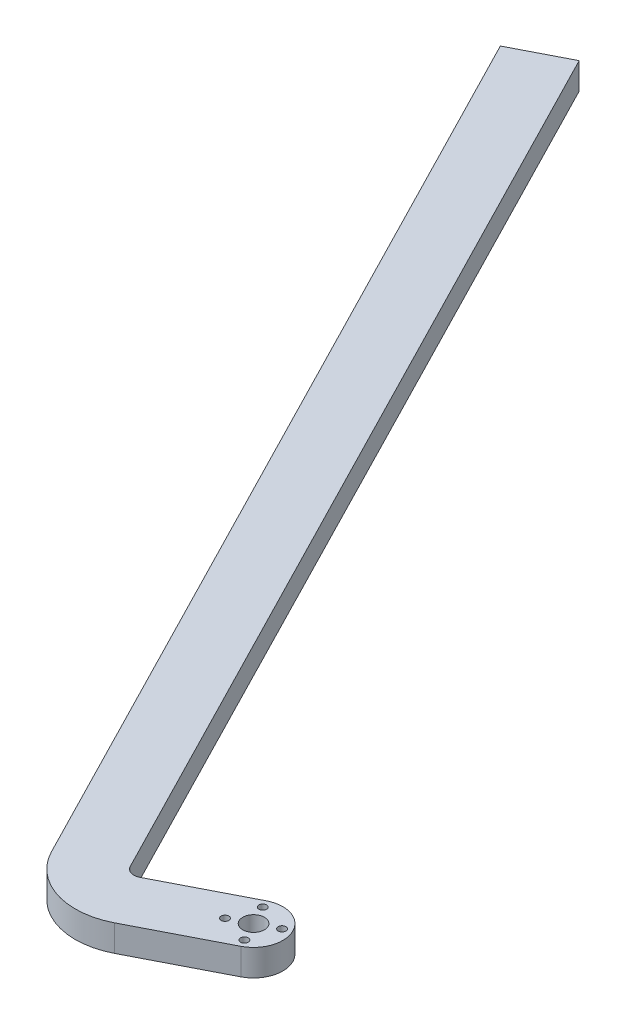
ISO-10303-21;
HEADER;
FILE_DESCRIPTION(('STEP AP214'),'2;1');
FILE_NAME('part.step','',(''),(''),'','','');
FILE_SCHEMA(('AUTOMOTIVE_DESIGN { 1 0 10303 214 1 1 1 1 }'));
ENDSEC;
DATA;
#1=APPLICATION_CONTEXT('core data for automotive mechanical design processes');
#2=APPLICATION_PROTOCOL_DEFINITION('international standard','automotive_design',2000,#1);
#3=PRODUCT_CONTEXT('',#1,'mechanical');
#4=PRODUCT('Part','Part','',(#3));
#5=PRODUCT_RELATED_PRODUCT_CATEGORY('part','',(#4));
#6=PRODUCT_DEFINITION_FORMATION('','',#4);
#7=PRODUCT_DEFINITION_CONTEXT('part definition',#1,'design');
#8=PRODUCT_DEFINITION('design','',#6,#7);
#9=PRODUCT_DEFINITION_SHAPE('','',#8);
#10=(LENGTH_UNIT() NAMED_UNIT(*) SI_UNIT(.MILLI.,.METRE.));
#11=(NAMED_UNIT(*) PLANE_ANGLE_UNIT() SI_UNIT($,.RADIAN.));
#12=(NAMED_UNIT(*) SI_UNIT($,.STERADIAN.) SOLID_ANGLE_UNIT());
#13=UNCERTAINTY_MEASURE_WITH_UNIT(LENGTH_MEASURE(1.E-05),#10,'distance_accuracy_value','');
#14=(GEOMETRIC_REPRESENTATION_CONTEXT(3) GLOBAL_UNCERTAINTY_ASSIGNED_CONTEXT((#13)) GLOBAL_UNIT_ASSIGNED_CONTEXT((#10,
#11,#12)) REPRESENTATION_CONTEXT('',''));
#15=CARTESIAN_POINT('',(0.,0.,0.));
#16=DIRECTION('',(0.,0.,1.));
#17=DIRECTION('',(1.,0.,0.));
#18=AXIS2_PLACEMENT_3D('',#15,#16,#17);
#19=CARTESIAN_POINT('',(-38.3857865547846,10.,2.7997402459546));
#20=DIRECTION('',(0.,-1.,0.));
#21=DIRECTION('',(0.,0.,-1.));
#22=AXIS2_PLACEMENT_3D('',#19,#20,#21);
#23=PLANE('',#22);
#24=DIRECTION('',(-0.889656473136453,0.,0.456630441173612));
#25=VECTOR('',#24,1.);
#26=CARTESIAN_POINT('',(-220.641241200218,10.,-343.557880956116));
#27=LINE('',#26,#25);
#28=CARTESIAN_POINT('',(-220.641241200218,10.,-343.557880956116));
#29=VERTEX_POINT('',#28);
#30=CARTESIAN_POINT('',(-240.302649256533,10.,-333.466348206179));
#31=VERTEX_POINT('',#30);
#32=EDGE_CURVE('E149',#29,#31,#27,.T.);
#33=ORIENTED_EDGE('',*,*,#32,.T.);
#34=DIRECTION('',(0.456630441173611,0.,0.889656473136454));
#35=VECTOR('',#34,1.);
#36=CARTESIAN_POINT('',(-61.5945322010366,10.,14.7120008583817));
#37=LINE('',#36,#35);
#38=CARTESIAN_POINT('',(-61.5945322010366,10.,14.7120008583817));
#39=VERTEX_POINT('',#38);
#40=EDGE_CURVE('E97',#31,#39,#37,.T.);
#41=ORIENTED_EDGE('',*,*,#40,.T.);
#42=CARTESIAN_POINT('',(-38.3857865547846,10.,2.7997402459546));
#43=DIRECTION('',(0.,1.,0.));
#44=DIRECTION('',(0.,0.,-1.));
#45=AXIS2_PLACEMENT_3D('',#42,#43,#44);
#46=CIRCLE('',#45,26.0873116163932);
#47=CARTESIAN_POINT('',(-26.4735259423575,10.,26.0084858922066));
#48=VERTEX_POINT('',#47);
#49=EDGE_CURVE('E164',#39,#48,#46,.T.);
#50=ORIENTED_EDGE('',*,*,#49,.T.);
#51=DIRECTION('',(0.889656473136454,0.,-0.456630441173611));
#52=VECTOR('',#51,1.);
#53=CARTESIAN_POINT('',(5.0457663749684,10.,9.83070402815781));
#54=LINE('',#53,#52);
#55=CARTESIAN_POINT('',(5.0457663749684,10.,9.83070402815781));
#56=VERTEX_POINT('',#55);
#57=EDGE_CURVE('E177',#48,#56,#54,.T.);
#58=ORIENTED_EDGE('',*,*,#57,.T.);
#59=CARTESIAN_POINT('',(0.,10.,0.));
#60=DIRECTION('',(0.,1.,0.));
#61=DIRECTION('',(0.,0.,1.));
#62=AXIS2_PLACEMENT_3D('',#59,#60,#61);
#63=CIRCLE('',#62,11.05);
#64=CARTESIAN_POINT('',(-5.0457663749684,10.,-9.83070402815781));
#65=VERTEX_POINT('',#64);
#66=EDGE_CURVE('E116',#56,#65,#63,.T.);
#67=ORIENTED_EDGE('',*,*,#66,.T.);
#68=DIRECTION('',(-0.889656473136454,0.,0.456630441173611));
#69=VECTOR('',#68,1.);
#70=CARTESIAN_POINT('',(-5.0457663749684,10.,-9.83070402815781));
#71=LINE('',#70,#69);
#72=CARTESIAN_POINT('',(-36.5650586922943,10.,6.34707783589098));
#73=VERTEX_POINT('',#72);
#74=EDGE_CURVE('E110',#65,#73,#71,.T.);
#75=ORIENTED_EDGE('',*,*,#74,.T.);
#76=CARTESIAN_POINT('',(-38.3857865547846,10.,2.79974024595459));
#77=DIRECTION('',(0.,-1.,0.));
#78=DIRECTION('',(0.,0.,-1.));
#79=AXIS2_PLACEMENT_3D('',#76,#77,#78);
#80=CIRCLE('',#79,3.98731161639319);
#81=CARTESIAN_POINT('',(-41.933124144721,10.,4.62046810844488));
#82=VERTEX_POINT('',#81);
#83=EDGE_CURVE('E114',#73,#82,#80,.T.);
#84=ORIENTED_EDGE('',*,*,#83,.T.);
#85=DIRECTION('',(-0.456630441173611,0.,-0.889656473136454));
#86=VECTOR('',#85,1.);
#87=CARTESIAN_POINT('',(-41.933124144721,10.,4.62046810844488));
#88=LINE('',#87,#86);
#89=EDGE_CURVE('E54',#82,#29,#88,.T.);
#90=ORIENTED_EDGE('',*,*,#89,.T.);
#91=EDGE_LOOP('',(#33,#41,#50,#58,#67,#75,#84,#90));
#92=FACE_BOUND('',#91,.T.);
#93=CARTESIAN_POINT('',(3.65304352938889,10.,7.11725178509162));
#94=DIRECTION('',(0.,1.,0.));
#95=DIRECTION('',(0.,0.,1.));
#96=AXIS2_PLACEMENT_3D('',#93,#94,#95);
#97=CIRCLE('',#96,1.45500000000002);
#98=CARTESIAN_POINT('',(3.65304352938889,10.,8.57225178509164));
#99=VERTEX_POINT('',#98);
#100=EDGE_CURVE('E138',#99,#99,#97,.T.);
#101=ORIENTED_EDGE('',*,*,#100,.F.);
#102=EDGE_LOOP('',(#101));
#103=FACE_BOUND('',#102,.T.);
#104=CARTESIAN_POINT('',(0.,10.,0.));
#105=DIRECTION('',(0.,1.,0.));
#106=DIRECTION('',(0.,0.,1.));
#107=AXIS2_PLACEMENT_3D('',#104,#105,#106);
#108=CIRCLE('',#107,4.09999999999999);
#109=CARTESIAN_POINT('',(0.,10.,4.09999999999999));
#110=VERTEX_POINT('',#109);
#111=EDGE_CURVE('E186',#110,#110,#108,.T.);
#112=ORIENTED_EDGE('',*,*,#111,.F.);
#113=EDGE_LOOP('',(#112));
#114=FACE_BOUND('',#113,.T.);
#115=CARTESIAN_POINT('',(-7.11725178509165,10.,3.6530435293889));
#116=DIRECTION('',(0.,1.,0.));
#117=DIRECTION('',(0.,0.,1.));
#118=AXIS2_PLACEMENT_3D('',#115,#116,#117);
#119=CIRCLE('',#118,1.45500000000002);
#120=CARTESIAN_POINT('',(-7.11725178509165,10.,5.10804352938892));
#121=VERTEX_POINT('',#120);
#122=EDGE_CURVE('E192',#121,#121,#119,.T.);
#123=ORIENTED_EDGE('',*,*,#122,.F.);
#124=EDGE_LOOP('',(#123));
#125=FACE_BOUND('',#124,.T.);
#126=CARTESIAN_POINT('',(7.11725178509159,10.,-3.65304352938887));
#127=DIRECTION('',(0.,1.,0.));
#128=DIRECTION('',(0.,0.,1.));
#129=AXIS2_PLACEMENT_3D('',#126,#127,#128);
#130=CIRCLE('',#129,1.45500000000002);
#131=CARTESIAN_POINT('',(7.11725178509159,10.,-2.19804352938885));
#132=VERTEX_POINT('',#131);
#133=EDGE_CURVE('E198',#132,#132,#130,.T.);
#134=ORIENTED_EDGE('',*,*,#133,.F.);
#135=EDGE_LOOP('',(#134));
#136=FACE_BOUND('',#135,.T.);
#137=CARTESIAN_POINT('',(-3.65304352938889,10.,-7.11725178509164));
#138=DIRECTION('',(0.,1.,0.));
#139=DIRECTION('',(0.,0.,1.));
#140=AXIS2_PLACEMENT_3D('',#137,#138,#139);
#141=CIRCLE('',#140,1.45500000000002);
#142=CARTESIAN_POINT('',(-3.65304352938889,10.,-5.66225178509162));
#143=VERTEX_POINT('',#142);
#144=EDGE_CURVE('E204',#143,#143,#141,.T.);
#145=ORIENTED_EDGE('',*,*,#144,.F.);
#146=EDGE_LOOP('',(#145));
#147=FACE_BOUND('',#146,.T.);
#148=ADVANCED_FACE('F37',(#92,#103,#114,#125,#136,#147),#23,.F.);
#149=CARTESIAN_POINT('',(-38.3857865547846,0.,2.7997402459546));
#150=DIRECTION('',(0.,-1.,0.));
#151=DIRECTION('',(0.,0.,-1.));
#152=AXIS2_PLACEMENT_3D('',#149,#150,#151);
#153=PLANE('',#152);
#154=CARTESIAN_POINT('',(7.11725178509159,0.,-3.65304352938887));
#155=DIRECTION('',(0.,1.,0.));
#156=DIRECTION('',(0.,0.,1.));
#157=AXIS2_PLACEMENT_3D('',#154,#155,#156);
#158=CIRCLE('',#157,1.45500000000002);
#159=CARTESIAN_POINT('',(7.11725178509159,0.,-2.19804352938885));
#160=VERTEX_POINT('',#159);
#161=EDGE_CURVE('E201',#160,#160,#158,.T.);
#162=ORIENTED_EDGE('',*,*,#161,.T.);
#163=EDGE_LOOP('',(#162));
#164=FACE_BOUND('',#163,.T.);
#165=CARTESIAN_POINT('',(0.,0.,0.));
#166=DIRECTION('',(0.,1.,0.));
#167=DIRECTION('',(0.,0.,1.));
#168=AXIS2_PLACEMENT_3D('',#165,#166,#167);
#169=CIRCLE('',#168,4.09999999999999);
#170=CARTESIAN_POINT('',(0.,0.,4.09999999999999));
#171=VERTEX_POINT('',#170);
#172=EDGE_CURVE('E189',#171,#171,#169,.T.);
#173=ORIENTED_EDGE('',*,*,#172,.T.);
#174=EDGE_LOOP('',(#173));
#175=FACE_BOUND('',#174,.T.);
#176=DIRECTION('',(-0.889656473136453,0.,0.456630441173612));
#177=VECTOR('',#176,1.);
#178=CARTESIAN_POINT('',(-220.641241200218,0.,-343.557880956116));
#179=LINE('',#178,#177);
#180=CARTESIAN_POINT('',(-220.641241200218,0.,-343.557880956116));
#181=VERTEX_POINT('',#180);
#182=CARTESIAN_POINT('',(-240.302649256533,0.,-333.466348206179));
#183=VERTEX_POINT('',#182);
#184=EDGE_CURVE('E134',#181,#183,#179,.T.);
#185=ORIENTED_EDGE('',*,*,#184,.F.);
#186=DIRECTION('',(-0.456630441173611,0.,-0.889656473136454));
#187=VECTOR('',#186,1.);
#188=CARTESIAN_POINT('',(-41.933124144721,0.,4.62046810844488));
#189=LINE('',#188,#187);
#190=CARTESIAN_POINT('',(-41.933124144721,0.,4.62046810844488));
#191=VERTEX_POINT('',#190);
#192=EDGE_CURVE('E89',#191,#181,#189,.T.);
#193=ORIENTED_EDGE('',*,*,#192,.F.);
#194=CARTESIAN_POINT('',(-38.3857865547846,0.,2.79974024595459));
#195=DIRECTION('',(0.,-1.,0.));
#196=DIRECTION('',(0.,0.,-1.));
#197=AXIS2_PLACEMENT_3D('',#194,#195,#196);
#198=CIRCLE('',#197,3.98731161639319);
#199=CARTESIAN_POINT('',(-36.5650586922943,0.,6.34707783589098));
#200=VERTEX_POINT('',#199);
#201=EDGE_CURVE('E83',#200,#191,#198,.T.);
#202=ORIENTED_EDGE('',*,*,#201,.F.);
#203=DIRECTION('',(-0.889656473136454,0.,0.456630441173611));
#204=VECTOR('',#203,1.);
#205=CARTESIAN_POINT('',(-5.0457663749684,0.,-9.83070402815781));
#206=LINE('',#205,#204);
#207=CARTESIAN_POINT('',(-5.0457663749684,0.,-9.83070402815781));
#208=VERTEX_POINT('',#207);
#209=EDGE_CURVE('E124',#208,#200,#206,.T.);
#210=ORIENTED_EDGE('',*,*,#209,.F.);
#211=CARTESIAN_POINT('',(0.,0.,0.));
#212=DIRECTION('',(0.,1.,0.));
#213=DIRECTION('',(0.,0.,1.));
#214=AXIS2_PLACEMENT_3D('',#211,#212,#213);
#215=CIRCLE('',#214,11.05);
#216=CARTESIAN_POINT('',(5.0457663749684,0.,9.83070402815781));
#217=VERTEX_POINT('',#216);
#218=EDGE_CURVE('E144',#217,#208,#215,.T.);
#219=ORIENTED_EDGE('',*,*,#218,.F.);
#220=DIRECTION('',(0.889656473136454,0.,-0.456630441173611));
#221=VECTOR('',#220,1.);
#222=CARTESIAN_POINT('',(5.0457663749684,0.,9.83070402815781));
#223=LINE('',#222,#221);
#224=CARTESIAN_POINT('',(-26.4735259423575,0.,26.0084858922066));
#225=VERTEX_POINT('',#224);
#226=EDGE_CURVE('E142',#225,#217,#223,.T.);
#227=ORIENTED_EDGE('',*,*,#226,.F.);
#228=CARTESIAN_POINT('',(-38.3857865547846,0.,2.7997402459546));
#229=DIRECTION('',(0.,1.,0.));
#230=DIRECTION('',(0.,0.,-1.));
#231=AXIS2_PLACEMENT_3D('',#228,#229,#230);
#232=CIRCLE('',#231,26.0873116163932);
#233=CARTESIAN_POINT('',(-61.5945322010366,0.,14.7120008583817));
#234=VERTEX_POINT('',#233);
#235=EDGE_CURVE('E140',#234,#225,#232,.T.);
#236=ORIENTED_EDGE('',*,*,#235,.F.);
#237=DIRECTION('',(0.456630441173611,0.,0.889656473136454));
#238=VECTOR('',#237,1.);
#239=CARTESIAN_POINT('',(-61.5945322010366,0.,14.7120008583817));
#240=LINE('',#239,#238);
#241=EDGE_CURVE('E137',#183,#234,#240,.T.);
#242=ORIENTED_EDGE('',*,*,#241,.F.);
#243=EDGE_LOOP('',(#185,#193,#202,#210,#219,#227,#236,#242));
#244=FACE_BOUND('',#243,.T.);
#245=CARTESIAN_POINT('',(3.65304352938889,0.,7.11725178509162));
#246=DIRECTION('',(0.,1.,0.));
#247=DIRECTION('',(0.,0.,1.));
#248=AXIS2_PLACEMENT_3D('',#245,#246,#247);
#249=CIRCLE('',#248,1.45500000000002);
#250=CARTESIAN_POINT('',(3.65304352938889,0.,8.57225178509164));
#251=VERTEX_POINT('',#250);
#252=EDGE_CURVE('E183',#251,#251,#249,.T.);
#253=ORIENTED_EDGE('',*,*,#252,.T.);
#254=EDGE_LOOP('',(#253));
#255=FACE_BOUND('',#254,.T.);
#256=CARTESIAN_POINT('',(-7.11725178509165,0.,3.6530435293889));
#257=DIRECTION('',(0.,1.,0.));
#258=DIRECTION('',(0.,0.,1.));
#259=AXIS2_PLACEMENT_3D('',#256,#257,#258);
#260=CIRCLE('',#259,1.45500000000002);
#261=CARTESIAN_POINT('',(-7.11725178509165,0.,5.10804352938892));
#262=VERTEX_POINT('',#261);
#263=EDGE_CURVE('E195',#262,#262,#260,.T.);
#264=ORIENTED_EDGE('',*,*,#263,.T.);
#265=EDGE_LOOP('',(#264));
#266=FACE_BOUND('',#265,.T.);
#267=CARTESIAN_POINT('',(-3.65304352938889,0.,-7.11725178509164));
#268=DIRECTION('',(0.,1.,0.));
#269=DIRECTION('',(0.,0.,1.));
#270=AXIS2_PLACEMENT_3D('',#267,#268,#269);
#271=CIRCLE('',#270,1.45500000000002);
#272=CARTESIAN_POINT('',(-3.65304352938889,0.,-5.66225178509162));
#273=VERTEX_POINT('',#272);
#274=EDGE_CURVE('E207',#273,#273,#271,.T.);
#275=ORIENTED_EDGE('',*,*,#274,.T.);
#276=EDGE_LOOP('',(#275));
#277=FACE_BOUND('',#276,.T.);
#278=ADVANCED_FACE('F168',(#164,#175,#244,#255,#266,#277),#153,.T.);
#279=CARTESIAN_POINT('',(-220.641241200218,10.,-343.557880956116));
#280=DIRECTION('',(0.456630441173612,0.,0.889656473136453));
#281=DIRECTION('',(0.889656473136453,0.,-0.456630441173612));
#282=AXIS2_PLACEMENT_3D('',#279,#280,#281);
#283=PLANE('',#282);
#284=ORIENTED_EDGE('',*,*,#184,.T.);
#285=DIRECTION('',(0.,-1.,0.));
#286=VECTOR('',#285,1.);
#287=CARTESIAN_POINT('',(-240.302649256533,10.,-333.466348206179));
#288=LINE('',#287,#286);
#289=EDGE_CURVE('E11',#31,#183,#288,.T.);
#290=ORIENTED_EDGE('',*,*,#289,.F.);
#291=ORIENTED_EDGE('',*,*,#32,.F.);
#292=DIRECTION('',(0.,-1.,0.));
#293=VECTOR('',#292,1.);
#294=CARTESIAN_POINT('',(-220.641241200218,10.,-343.557880956116));
#295=LINE('',#294,#293);
#296=EDGE_CURVE('E130',#29,#181,#295,.T.);
#297=ORIENTED_EDGE('',*,*,#296,.T.);
#298=EDGE_LOOP('',(#284,#290,#291,#297));
#299=FACE_BOUND('',#298,.T.);
#300=ADVANCED_FACE('F39',(#299),#283,.F.);
#301=CARTESIAN_POINT('',(-61.5945322010366,10.,14.7120008583817));
#302=DIRECTION('',(0.889656473136454,0.,-0.456630441173611));
#303=DIRECTION('',(-0.456630441173611,0.,-0.889656473136454));
#304=AXIS2_PLACEMENT_3D('',#301,#302,#303);
#305=PLANE('',#304);
#306=ORIENTED_EDGE('',*,*,#241,.T.);
#307=DIRECTION('',(0.,-1.,0.));
#308=VECTOR('',#307,1.);
#309=CARTESIAN_POINT('',(-61.5945322010366,10.,14.7120008583817));
#310=LINE('',#309,#308);
#311=EDGE_CURVE('E46',#39,#234,#310,.T.);
#312=ORIENTED_EDGE('',*,*,#311,.F.);
#313=ORIENTED_EDGE('',*,*,#40,.F.);
#314=ORIENTED_EDGE('',*,*,#289,.T.);
#315=EDGE_LOOP('',(#306,#312,#313,#314));
#316=FACE_BOUND('',#315,.T.);
#317=ADVANCED_FACE('F239',(#316),#305,.F.);
#318=CARTESIAN_POINT('',(-38.3857865547846,10.,2.7997402459546));
#319=DIRECTION('',(0.,-1.,0.));
#320=DIRECTION('',(0.,0.,-1.));
#321=AXIS2_PLACEMENT_3D('',#318,#319,#320);
#322=CYLINDRICAL_SURFACE('',#321,26.0873116163932);
#323=ORIENTED_EDGE('',*,*,#235,.T.);
#324=DIRECTION('',(0.,-1.,0.));
#325=VECTOR('',#324,1.);
#326=CARTESIAN_POINT('',(-26.4735259423575,10.,26.0084858922066));
#327=LINE('',#326,#325);
#328=EDGE_CURVE('E156',#48,#225,#327,.T.);
#329=ORIENTED_EDGE('',*,*,#328,.F.);
#330=ORIENTED_EDGE('',*,*,#49,.F.);
#331=ORIENTED_EDGE('',*,*,#311,.T.);
#332=EDGE_LOOP('',(#323,#329,#330,#331));
#333=FACE_BOUND('',#332,.T.);
#334=ADVANCED_FACE('F162',(#333),#322,.T.);
#335=CARTESIAN_POINT('',(5.0457663749684,10.,9.83070402815781));
#336=DIRECTION('',(-0.456630441173611,0.,-0.889656473136454));
#337=DIRECTION('',(-0.889656473136454,0.,0.456630441173611));
#338=AXIS2_PLACEMENT_3D('',#335,#336,#337);
#339=PLANE('',#338);
#340=ORIENTED_EDGE('',*,*,#226,.T.);
#341=DIRECTION('',(0.,-1.,0.));
#342=VECTOR('',#341,1.);
#343=CARTESIAN_POINT('',(5.0457663749684,10.,9.83070402815781));
#344=LINE('',#343,#342);
#345=EDGE_CURVE('E153',#56,#217,#344,.T.);
#346=ORIENTED_EDGE('',*,*,#345,.F.);
#347=ORIENTED_EDGE('',*,*,#57,.F.);
#348=ORIENTED_EDGE('',*,*,#328,.T.);
#349=EDGE_LOOP('',(#340,#346,#347,#348));
#350=FACE_BOUND('',#349,.T.);
#351=ADVANCED_FACE('F173',(#350),#339,.F.);
#352=CARTESIAN_POINT('',(0.,10.,0.));
#353=DIRECTION('',(0.,-1.,0.));
#354=DIRECTION('',(0.,0.,-1.));
#355=AXIS2_PLACEMENT_3D('',#352,#353,#354);
#356=CYLINDRICAL_SURFACE('',#355,11.05);
#357=ORIENTED_EDGE('',*,*,#218,.T.);
#358=DIRECTION('',(0.,-1.,0.));
#359=VECTOR('',#358,1.);
#360=CARTESIAN_POINT('',(-5.0457663749684,10.,-9.83070402815781));
#361=LINE('',#360,#359);
#362=EDGE_CURVE('E125',#65,#208,#361,.T.);
#363=ORIENTED_EDGE('',*,*,#362,.F.);
#364=ORIENTED_EDGE('',*,*,#66,.F.);
#365=ORIENTED_EDGE('',*,*,#345,.T.);
#366=EDGE_LOOP('',(#357,#363,#364,#365));
#367=FACE_BOUND('',#366,.T.);
#368=ADVANCED_FACE('F176',(#367),#356,.T.);
#369=CARTESIAN_POINT('',(-5.0457663749684,10.,-9.83070402815781));
#370=DIRECTION('',(0.456630441173611,0.,0.889656473136454));
#371=DIRECTION('',(0.889656473136454,0.,-0.456630441173611));
#372=AXIS2_PLACEMENT_3D('',#369,#370,#371);
#373=PLANE('',#372);
#374=ORIENTED_EDGE('',*,*,#209,.T.);
#375=DIRECTION('',(0.,-1.,0.));
#376=VECTOR('',#375,1.);
#377=CARTESIAN_POINT('',(-36.5650586922943,10.,6.34707783589098));
#378=LINE('',#377,#376);
#379=EDGE_CURVE('E121',#73,#200,#378,.T.);
#380=ORIENTED_EDGE('',*,*,#379,.F.);
#381=ORIENTED_EDGE('',*,*,#74,.F.);
#382=ORIENTED_EDGE('',*,*,#362,.T.);
#383=EDGE_LOOP('',(#374,#380,#381,#382));
#384=FACE_BOUND('',#383,.T.);
#385=ADVANCED_FACE('F122',(#384),#373,.F.);
#386=CARTESIAN_POINT('',(-38.3857865547846,10.,2.79974024595459));
#387=DIRECTION('',(0.,-1.,0.));
#388=DIRECTION('',(0.,0.,-1.));
#389=AXIS2_PLACEMENT_3D('',#386,#387,#388);
#390=CYLINDRICAL_SURFACE('',#389,3.98731161639319);
#391=ORIENTED_EDGE('',*,*,#201,.T.);
#392=DIRECTION('',(0.,-1.,0.));
#393=VECTOR('',#392,1.);
#394=CARTESIAN_POINT('',(-41.933124144721,10.,4.62046810844488));
#395=LINE('',#394,#393);
#396=EDGE_CURVE('E126',#82,#191,#395,.T.);
#397=ORIENTED_EDGE('',*,*,#396,.F.);
#398=ORIENTED_EDGE('',*,*,#83,.F.);
#399=ORIENTED_EDGE('',*,*,#379,.T.);
#400=EDGE_LOOP('',(#391,#397,#398,#399));
#401=FACE_BOUND('',#400,.T.);
#402=ADVANCED_FACE('F128',(#401),#390,.F.);
#403=CARTESIAN_POINT('',(-41.933124144721,10.,4.62046810844488));
#404=DIRECTION('',(-0.889656473136454,0.,0.456630441173611));
#405=DIRECTION('',(0.456630441173611,0.,0.889656473136454));
#406=AXIS2_PLACEMENT_3D('',#403,#404,#405);
#407=PLANE('',#406);
#408=ORIENTED_EDGE('',*,*,#192,.T.);
#409=ORIENTED_EDGE('',*,*,#296,.F.);
#410=ORIENTED_EDGE('',*,*,#89,.F.);
#411=ORIENTED_EDGE('',*,*,#396,.T.);
#412=EDGE_LOOP('',(#408,#409,#410,#411));
#413=FACE_BOUND('',#412,.T.);
#414=ADVANCED_FACE('F227',(#413),#407,.F.);
#415=CARTESIAN_POINT('',(3.65304352938889,10.,7.11725178509162));
#416=DIRECTION('',(0.,-1.,0.));
#417=DIRECTION('',(0.,0.,-1.));
#418=AXIS2_PLACEMENT_3D('',#415,#416,#417);
#419=CYLINDRICAL_SURFACE('',#418,1.45500000000002);
#420=ORIENTED_EDGE('',*,*,#100,.T.);
#421=EDGE_LOOP('',(#420));
#422=FACE_BOUND('',#421,.T.);
#423=ORIENTED_EDGE('',*,*,#252,.F.);
#424=EDGE_LOOP('',(#423));
#425=FACE_BOUND('',#424,.T.);
#426=ADVANCED_FACE('F224',(#422,#425),#419,.F.);
#427=CARTESIAN_POINT('',(0.,10.,0.));
#428=DIRECTION('',(0.,-1.,0.));
#429=DIRECTION('',(0.,0.,-1.));
#430=AXIS2_PLACEMENT_3D('',#427,#428,#429);
#431=CYLINDRICAL_SURFACE('',#430,4.09999999999999);
#432=ORIENTED_EDGE('',*,*,#111,.T.);
#433=EDGE_LOOP('',(#432));
#434=FACE_BOUND('',#433,.T.);
#435=ORIENTED_EDGE('',*,*,#172,.F.);
#436=EDGE_LOOP('',(#435));
#437=FACE_BOUND('',#436,.T.);
#438=ADVANCED_FACE('F303',(#434,#437),#431,.F.);
#439=CARTESIAN_POINT('',(-7.11725178509165,10.,3.6530435293889));
#440=DIRECTION('',(0.,-1.,0.));
#441=DIRECTION('',(0.,0.,-1.));
#442=AXIS2_PLACEMENT_3D('',#439,#440,#441);
#443=CYLINDRICAL_SURFACE('',#442,1.45500000000002);
#444=ORIENTED_EDGE('',*,*,#122,.T.);
#445=EDGE_LOOP('',(#444));
#446=FACE_BOUND('',#445,.T.);
#447=ORIENTED_EDGE('',*,*,#263,.F.);
#448=EDGE_LOOP('',(#447));
#449=FACE_BOUND('',#448,.T.);
#450=ADVANCED_FACE('F311',(#446,#449),#443,.F.);
#451=CARTESIAN_POINT('',(7.11725178509159,10.,-3.65304352938887));
#452=DIRECTION('',(0.,-1.,0.));
#453=DIRECTION('',(0.,0.,-1.));
#454=AXIS2_PLACEMENT_3D('',#451,#452,#453);
#455=CYLINDRICAL_SURFACE('',#454,1.45500000000002);
#456=ORIENTED_EDGE('',*,*,#133,.T.);
#457=EDGE_LOOP('',(#456));
#458=FACE_BOUND('',#457,.T.);
#459=ORIENTED_EDGE('',*,*,#161,.F.);
#460=EDGE_LOOP('',(#459));
#461=FACE_BOUND('',#460,.T.);
#462=ADVANCED_FACE('F319',(#458,#461),#455,.F.);
#463=CARTESIAN_POINT('',(-3.65304352938889,10.,-7.11725178509164));
#464=DIRECTION('',(0.,-1.,0.));
#465=DIRECTION('',(0.,0.,-1.));
#466=AXIS2_PLACEMENT_3D('',#463,#464,#465);
#467=CYLINDRICAL_SURFACE('',#466,1.45500000000002);
#468=ORIENTED_EDGE('',*,*,#144,.T.);
#469=EDGE_LOOP('',(#468));
#470=FACE_BOUND('',#469,.T.);
#471=ORIENTED_EDGE('',*,*,#274,.F.);
#472=EDGE_LOOP('',(#471));
#473=FACE_BOUND('',#472,.T.);
#474=ADVANCED_FACE('F213',(#470,#473),#467,.F.);
#475=CLOSED_SHELL('',(#148,#278,#300,#317,#334,#351,#368,#385,#402,#414,#426,#438,#450,#462,#474));
#476=MANIFOLD_SOLID_BREP('B2',#475);
#477=ADVANCED_BREP_SHAPE_REPRESENTATION('',(#18,#476),#14);
#478=SHAPE_DEFINITION_REPRESENTATION(#9,#477);
ENDSEC;
END-ISO-10303-21;
